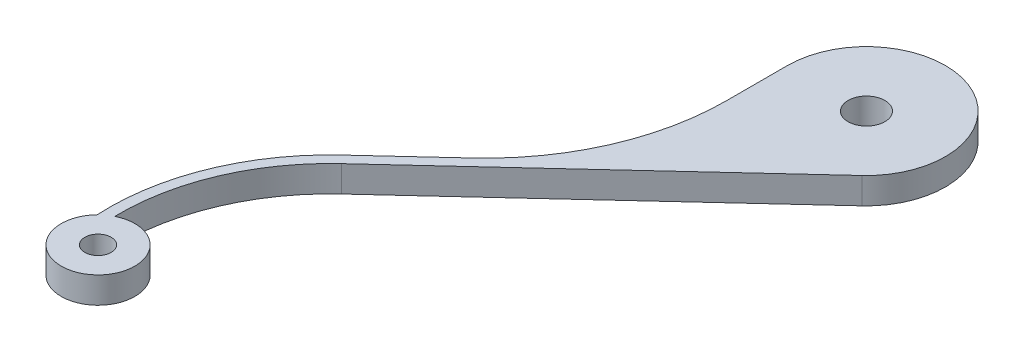
ISO-10303-21;
HEADER;
FILE_DESCRIPTION(('STEP AP214'),'2;1');
FILE_NAME('part.step','',(''),(''),'','','');
FILE_SCHEMA(('AUTOMOTIVE_DESIGN { 1 0 10303 214 1 1 1 1 }'));
ENDSEC;
DATA;
#1=APPLICATION_CONTEXT('core data for automotive mechanical design processes');
#2=APPLICATION_PROTOCOL_DEFINITION('international standard','automotive_design',2000,#1);
#3=PRODUCT_CONTEXT('',#1,'mechanical');
#4=PRODUCT('Part','Part','',(#3));
#5=PRODUCT_RELATED_PRODUCT_CATEGORY('part','',(#4));
#6=PRODUCT_DEFINITION_FORMATION('','',#4);
#7=PRODUCT_DEFINITION_CONTEXT('part definition',#1,'design');
#8=PRODUCT_DEFINITION('design','',#6,#7);
#9=PRODUCT_DEFINITION_SHAPE('','',#8);
#10=(LENGTH_UNIT() NAMED_UNIT(*) SI_UNIT(.MILLI.,.METRE.));
#11=(NAMED_UNIT(*) PLANE_ANGLE_UNIT() SI_UNIT($,.RADIAN.));
#12=(NAMED_UNIT(*) SI_UNIT($,.STERADIAN.) SOLID_ANGLE_UNIT());
#13=UNCERTAINTY_MEASURE_WITH_UNIT(LENGTH_MEASURE(1.E-05),#10,'distance_accuracy_value','');
#14=(GEOMETRIC_REPRESENTATION_CONTEXT(3) GLOBAL_UNCERTAINTY_ASSIGNED_CONTEXT((#13)) GLOBAL_UNIT_ASSIGNED_CONTEXT((#10,
#11,#12)) REPRESENTATION_CONTEXT('',''));
#15=CARTESIAN_POINT('',(0.,0.,0.));
#16=DIRECTION('',(0.,0.,1.));
#17=DIRECTION('',(1.,0.,0.));
#18=AXIS2_PLACEMENT_3D('',#15,#16,#17);
#19=CARTESIAN_POINT('',(0.,5.,0.));
#20=DIRECTION('',(0.,1.,0.));
#21=DIRECTION('',(0.,0.,1.));
#22=AXIS2_PLACEMENT_3D('',#19,#20,#21);
#23=PLANE('',#22);
#24=CARTESIAN_POINT('',(0.,5.,0.));
#25=DIRECTION('',(0.,1.,0.));
#26=DIRECTION('',(0.,0.,1.));
#27=AXIS2_PLACEMENT_3D('',#24,#25,#26);
#28=CIRCLE('',#27,3.5);
#29=CARTESIAN_POINT('',(0.,5.,3.5));
#30=VERTEX_POINT('',#29);
#31=EDGE_CURVE('E132',#30,#30,#28,.T.);
#32=ORIENTED_EDGE('',*,*,#31,.F.);
#33=EDGE_LOOP('',(#32));
#34=FACE_BOUND('',#33,.T.);
#35=CARTESIAN_POINT('',(0.,5.,0.));
#36=DIRECTION('',(0.,1.,0.));
#37=DIRECTION('',(0.,0.,1.));
#38=AXIS2_PLACEMENT_3D('',#35,#36,#37);
#39=CIRCLE('',#38,15.);
#40=CARTESIAN_POINT('',(10.1804788039535,5.,11.016253960501));
#41=VERTEX_POINT('',#40);
#42=CARTESIAN_POINT('',(-15.,5.,0.));
#43=VERTEX_POINT('',#42);
#44=EDGE_CURVE('E143',#41,#43,#39,.T.);
#45=ORIENTED_EDGE('',*,*,#44,.T.);
#46=DIRECTION('',(0.,0.,1.));
#47=VECTOR('',#46,1.);
#48=CARTESIAN_POINT('',(-15.,5.,0.));
#49=LINE('',#48,#47);
#50=CARTESIAN_POINT('',(-15.,5.,11.5189970029999));
#51=VERTEX_POINT('',#50);
#52=EDGE_CURVE('E91',#43,#51,#49,.T.);
#53=ORIENTED_EDGE('',*,*,#52,.T.);
#54=CARTESIAN_POINT('',(-60.8159590386569,5.,11.5189970029999));
#55=DIRECTION('',(0.,-1.,0.));
#56=DIRECTION('',(0.,0.,-1.));
#57=AXIS2_PLACEMENT_3D('',#54,#55,#56);
#58=CIRCLE('',#57,45.8159590386569);
#59=CARTESIAN_POINT('',(-29.7207323802671,5.,45.1670130172502));
#60=VERTEX_POINT('',#59);
#61=EDGE_CURVE('E158',#51,#60,#58,.T.);
#62=ORIENTED_EDGE('',*,*,#61,.T.);
#63=DIRECTION('',(-0.734416930700067,0.,0.678698586930231));
#64=VECTOR('',#63,1.);
#65=CARTESIAN_POINT('',(-29.7207323802671,5.,45.1670130172502));
#66=LINE('',#65,#64);
#67=CARTESIAN_POINT('',(-42.5861035189116,5.,57.0563211842171));
#68=VERTEX_POINT('',#67);
#69=EDGE_CURVE('E171',#60,#68,#66,.T.);
#70=ORIENTED_EDGE('',*,*,#69,.T.);
#71=CARTESIAN_POINT('',(-14.0807628678419,5.,87.9018322736199));
#72=DIRECTION('',(0.,1.,0.));
#73=DIRECTION('',(0.,0.,1.));
#74=AXIS2_PLACEMENT_3D('',#71,#72,#73);
#75=CIRCLE('',#74,42.);
#76=CARTESIAN_POINT('',(-56.0210743435811,5.,90.1401962560815));
#77=VERTEX_POINT('',#76);
#78=EDGE_CURVE('E110',#68,#77,#75,.T.);
#79=ORIENTED_EDGE('',*,*,#78,.T.);
#80=CARTESIAN_POINT('',(-50.9829886386138,5.,95.));
#81=DIRECTION('',(0.,1.,0.));
#82=DIRECTION('',(0.,0.,-1.));
#83=AXIS2_PLACEMENT_3D('',#80,#81,#82);
#84=CIRCLE('',#83,7.00000000000001);
#85=CARTESIAN_POINT('',(-54.0724221774994,5.,88.7186466101));
#86=VERTEX_POINT('',#85);
#87=EDGE_CURVE('E104',#77,#86,#84,.T.);
#88=ORIENTED_EDGE('',*,*,#87,.T.);
#89=CARTESIAN_POINT('',(-14.0807628678419,5.,87.9018322736199));
#90=DIRECTION('',(0.,-1.,0.));
#91=DIRECTION('',(0.,0.,1.));
#92=AXIS2_PLACEMENT_3D('',#89,#90,#91);
#93=CIRCLE('',#92,40.);
#94=CARTESIAN_POINT('',(-41.2287063450512,5.,58.5251550456173));
#95=VERTEX_POINT('',#94);
#96=EDGE_CURVE('E108',#86,#95,#93,.T.);
#97=ORIENTED_EDGE('',*,*,#96,.T.);
#98=DIRECTION('',(0.734416930700066,0.,-0.678698586930232));
#99=VECTOR('',#98,1.);
#100=CARTESIAN_POINT('',(10.1804788039535,5.,11.016253960501));
#101=LINE('',#100,#99);
#102=EDGE_CURVE('E48',#95,#41,#101,.T.);
#103=ORIENTED_EDGE('',*,*,#102,.T.);
#104=EDGE_LOOP('',(#45,#53,#62,#70,#79,#88,#97,#103));
#105=FACE_BOUND('',#104,.T.);
#106=CARTESIAN_POINT('',(-50.9829886386138,5.,95.));
#107=DIRECTION('',(0.,1.,0.));
#108=DIRECTION('',(0.,0.,1.));
#109=AXIS2_PLACEMENT_3D('',#106,#107,#108);
#110=CIRCLE('',#109,2.5);
#111=CARTESIAN_POINT('',(-50.9829886386138,5.,97.5));
#112=VERTEX_POINT('',#111);
#113=EDGE_CURVE('E180',#112,#112,#110,.T.);
#114=ORIENTED_EDGE('',*,*,#113,.F.);
#115=EDGE_LOOP('',(#114));
#116=FACE_BOUND('',#115,.T.);
#117=ADVANCED_FACE('F31',(#34,#105,#116),#23,.T.);
#118=CARTESIAN_POINT('',(0.,0.,0.));
#119=DIRECTION('',(0.,1.,0.));
#120=DIRECTION('',(0.,0.,1.));
#121=AXIS2_PLACEMENT_3D('',#118,#119,#120);
#122=PLANE('',#121);
#123=CARTESIAN_POINT('',(0.,0.,0.));
#124=DIRECTION('',(0.,1.,0.));
#125=DIRECTION('',(0.,0.,1.));
#126=AXIS2_PLACEMENT_3D('',#123,#124,#125);
#127=CIRCLE('',#126,3.5);
#128=CARTESIAN_POINT('',(0.,0.,3.5));
#129=VERTEX_POINT('',#128);
#130=EDGE_CURVE('E177',#129,#129,#127,.T.);
#131=ORIENTED_EDGE('',*,*,#130,.T.);
#132=EDGE_LOOP('',(#131));
#133=FACE_BOUND('',#132,.T.);
#134=CARTESIAN_POINT('',(0.,0.,0.));
#135=DIRECTION('',(0.,1.,0.));
#136=DIRECTION('',(0.,0.,1.));
#137=AXIS2_PLACEMENT_3D('',#134,#135,#136);
#138=CIRCLE('',#137,15.);
#139=CARTESIAN_POINT('',(10.1804788039535,0.,11.016253960501));
#140=VERTEX_POINT('',#139);
#141=CARTESIAN_POINT('',(-15.,0.,0.));
#142=VERTEX_POINT('',#141);
#143=EDGE_CURVE('E128',#140,#142,#138,.T.);
#144=ORIENTED_EDGE('',*,*,#143,.F.);
#145=DIRECTION('',(0.734416930700066,0.,-0.678698586930232));
#146=VECTOR('',#145,1.);
#147=CARTESIAN_POINT('',(10.1804788039535,0.,11.016253960501));
#148=LINE('',#147,#146);
#149=CARTESIAN_POINT('',(-41.2287063450512,0.,58.5251550456173));
#150=VERTEX_POINT('',#149);
#151=EDGE_CURVE('E83',#150,#140,#148,.T.);
#152=ORIENTED_EDGE('',*,*,#151,.F.);
#153=CARTESIAN_POINT('',(-14.0807628678419,0.,87.9018322736199));
#154=DIRECTION('',(0.,-1.,0.));
#155=DIRECTION('',(0.,0.,1.));
#156=AXIS2_PLACEMENT_3D('',#153,#154,#155);
#157=CIRCLE('',#156,40.);
#158=CARTESIAN_POINT('',(-54.0724221774994,0.,88.7186466101));
#159=VERTEX_POINT('',#158);
#160=EDGE_CURVE('E77',#159,#150,#157,.T.);
#161=ORIENTED_EDGE('',*,*,#160,.F.);
#162=CARTESIAN_POINT('',(-50.9829886386138,0.,95.));
#163=DIRECTION('',(0.,1.,0.));
#164=DIRECTION('',(0.,0.,-1.));
#165=AXIS2_PLACEMENT_3D('',#162,#163,#164);
#166=CIRCLE('',#165,7.00000000000001);
#167=CARTESIAN_POINT('',(-56.0210743435811,0.,90.1401962560815));
#168=VERTEX_POINT('',#167);
#169=EDGE_CURVE('E118',#168,#159,#166,.T.);
#170=ORIENTED_EDGE('',*,*,#169,.F.);
#171=CARTESIAN_POINT('',(-14.0807628678419,0.,87.9018322736199));
#172=DIRECTION('',(0.,1.,0.));
#173=DIRECTION('',(0.,0.,1.));
#174=AXIS2_PLACEMENT_3D('',#171,#172,#173);
#175=CIRCLE('',#174,42.);
#176=CARTESIAN_POINT('',(-42.5861035189116,0.,57.0563211842171));
#177=VERTEX_POINT('',#176);
#178=EDGE_CURVE('E138',#177,#168,#175,.T.);
#179=ORIENTED_EDGE('',*,*,#178,.F.);
#180=DIRECTION('',(-0.734416930700067,0.,0.678698586930231));
#181=VECTOR('',#180,1.);
#182=CARTESIAN_POINT('',(-29.7207323802671,0.,45.1670130172502));
#183=LINE('',#182,#181);
#184=CARTESIAN_POINT('',(-29.7207323802671,0.,45.1670130172502));
#185=VERTEX_POINT('',#184);
#186=EDGE_CURVE('E136',#185,#177,#183,.T.);
#187=ORIENTED_EDGE('',*,*,#186,.F.);
#188=CARTESIAN_POINT('',(-60.8159590386569,0.,11.5189970029999));
#189=DIRECTION('',(0.,-1.,0.));
#190=DIRECTION('',(0.,0.,-1.));
#191=AXIS2_PLACEMENT_3D('',#188,#189,#190);
#192=CIRCLE('',#191,45.8159590386569);
#193=CARTESIAN_POINT('',(-15.,0.,11.5189970029999));
#194=VERTEX_POINT('',#193);
#195=EDGE_CURVE('E134',#194,#185,#192,.T.);
#196=ORIENTED_EDGE('',*,*,#195,.F.);
#197=DIRECTION('',(0.,0.,1.));
#198=VECTOR('',#197,1.);
#199=CARTESIAN_POINT('',(-15.,0.,0.));
#200=LINE('',#199,#198);
#201=EDGE_CURVE('E131',#142,#194,#200,.T.);
#202=ORIENTED_EDGE('',*,*,#201,.F.);
#203=EDGE_LOOP('',(#144,#152,#161,#170,#179,#187,#196,#202));
#204=FACE_BOUND('',#203,.T.);
#205=CARTESIAN_POINT('',(-50.9829886386138,0.,95.));
#206=DIRECTION('',(0.,1.,0.));
#207=DIRECTION('',(0.,0.,1.));
#208=AXIS2_PLACEMENT_3D('',#205,#206,#207);
#209=CIRCLE('',#208,2.5);
#210=CARTESIAN_POINT('',(-50.9829886386138,0.,97.5));
#211=VERTEX_POINT('',#210);
#212=EDGE_CURVE('E183',#211,#211,#209,.T.);
#213=ORIENTED_EDGE('',*,*,#212,.T.);
#214=EDGE_LOOP('',(#213));
#215=FACE_BOUND('',#214,.T.);
#216=ADVANCED_FACE('F162',(#133,#204,#215),#122,.F.);
#217=CARTESIAN_POINT('',(0.,5.,0.));
#218=DIRECTION('',(0.,-1.,0.));
#219=DIRECTION('',(0.,0.,-1.));
#220=AXIS2_PLACEMENT_3D('',#217,#218,#219);
#221=CYLINDRICAL_SURFACE('',#220,15.);
#222=ORIENTED_EDGE('',*,*,#143,.T.);
#223=DIRECTION('',(0.,-1.,0.));
#224=VECTOR('',#223,1.);
#225=CARTESIAN_POINT('',(-15.,5.,0.));
#226=LINE('',#225,#224);
#227=EDGE_CURVE('E11',#43,#142,#226,.T.);
#228=ORIENTED_EDGE('',*,*,#227,.F.);
#229=ORIENTED_EDGE('',*,*,#44,.F.);
#230=DIRECTION('',(0.,-1.,0.));
#231=VECTOR('',#230,1.);
#232=CARTESIAN_POINT('',(10.1804788039535,5.,11.016253960501));
#233=LINE('',#232,#231);
#234=EDGE_CURVE('E124',#41,#140,#233,.T.);
#235=ORIENTED_EDGE('',*,*,#234,.T.);
#236=EDGE_LOOP('',(#222,#228,#229,#235));
#237=FACE_BOUND('',#236,.T.);
#238=ADVANCED_FACE('F33',(#237),#221,.T.);
#239=CARTESIAN_POINT('',(-15.,5.,0.));
#240=DIRECTION('',(1.,0.,0.));
#241=DIRECTION('',(0.,0.,-1.));
#242=AXIS2_PLACEMENT_3D('',#239,#240,#241);
#243=PLANE('',#242);
#244=ORIENTED_EDGE('',*,*,#201,.T.);
#245=DIRECTION('',(0.,-1.,0.));
#246=VECTOR('',#245,1.);
#247=CARTESIAN_POINT('',(-15.,5.,11.5189970029999));
#248=LINE('',#247,#246);
#249=EDGE_CURVE('E40',#51,#194,#248,.T.);
#250=ORIENTED_EDGE('',*,*,#249,.F.);
#251=ORIENTED_EDGE('',*,*,#52,.F.);
#252=ORIENTED_EDGE('',*,*,#227,.T.);
#253=EDGE_LOOP('',(#244,#250,#251,#252));
#254=FACE_BOUND('',#253,.T.);
#255=ADVANCED_FACE('F216',(#254),#243,.F.);
#256=CARTESIAN_POINT('',(-60.8159590386569,5.,11.5189970029999));
#257=DIRECTION('',(0.,-1.,0.));
#258=DIRECTION('',(0.,0.,-1.));
#259=AXIS2_PLACEMENT_3D('',#256,#257,#258);
#260=CYLINDRICAL_SURFACE('',#259,45.8159590386569);
#261=ORIENTED_EDGE('',*,*,#195,.T.);
#262=DIRECTION('',(0.,-1.,0.));
#263=VECTOR('',#262,1.);
#264=CARTESIAN_POINT('',(-29.7207323802671,5.,45.1670130172502));
#265=LINE('',#264,#263);
#266=EDGE_CURVE('E150',#60,#185,#265,.T.);
#267=ORIENTED_EDGE('',*,*,#266,.F.);
#268=ORIENTED_EDGE('',*,*,#61,.F.);
#269=ORIENTED_EDGE('',*,*,#249,.T.);
#270=EDGE_LOOP('',(#261,#267,#268,#269));
#271=FACE_BOUND('',#270,.T.);
#272=ADVANCED_FACE('F156',(#271),#260,.F.);
#273=CARTESIAN_POINT('',(-29.7207323802671,5.,45.1670130172502));
#274=DIRECTION('',(0.678698586930231,0.,0.734416930700067));
#275=DIRECTION('',(0.734416930700067,0.,-0.678698586930231));
#276=AXIS2_PLACEMENT_3D('',#273,#274,#275);
#277=PLANE('',#276);
#278=ORIENTED_EDGE('',*,*,#186,.T.);
#279=DIRECTION('',(0.,-1.,0.));
#280=VECTOR('',#279,1.);
#281=CARTESIAN_POINT('',(-42.5861035189116,5.,57.0563211842171));
#282=LINE('',#281,#280);
#283=EDGE_CURVE('E147',#68,#177,#282,.T.);
#284=ORIENTED_EDGE('',*,*,#283,.F.);
#285=ORIENTED_EDGE('',*,*,#69,.F.);
#286=ORIENTED_EDGE('',*,*,#266,.T.);
#287=EDGE_LOOP('',(#278,#284,#285,#286));
#288=FACE_BOUND('',#287,.T.);
#289=ADVANCED_FACE('F167',(#288),#277,.F.);
#290=CARTESIAN_POINT('',(-14.0807628678419,5.,87.9018322736199));
#291=DIRECTION('',(0.,-1.,0.));
#292=DIRECTION('',(0.,0.,-1.));
#293=AXIS2_PLACEMENT_3D('',#290,#291,#292);
#294=CYLINDRICAL_SURFACE('',#293,42.);
#295=ORIENTED_EDGE('',*,*,#178,.T.);
#296=DIRECTION('',(0.,-1.,0.));
#297=VECTOR('',#296,1.);
#298=CARTESIAN_POINT('',(-56.0210743435811,5.,90.1401962560815));
#299=LINE('',#298,#297);
#300=EDGE_CURVE('E119',#77,#168,#299,.T.);
#301=ORIENTED_EDGE('',*,*,#300,.F.);
#302=ORIENTED_EDGE('',*,*,#78,.F.);
#303=ORIENTED_EDGE('',*,*,#283,.T.);
#304=EDGE_LOOP('',(#295,#301,#302,#303));
#305=FACE_BOUND('',#304,.T.);
#306=ADVANCED_FACE('F170',(#305),#294,.T.);
#307=CARTESIAN_POINT('',(-50.9829886386138,5.,95.));
#308=DIRECTION('',(0.,-1.,0.));
#309=DIRECTION('',(0.,0.,-1.));
#310=AXIS2_PLACEMENT_3D('',#307,#308,#309);
#311=CYLINDRICAL_SURFACE('',#310,7.00000000000001);
#312=ORIENTED_EDGE('',*,*,#169,.T.);
#313=DIRECTION('',(0.,-1.,0.));
#314=VECTOR('',#313,1.);
#315=CARTESIAN_POINT('',(-54.0724221774994,5.,88.7186466101));
#316=LINE('',#315,#314);
#317=EDGE_CURVE('E115',#86,#159,#316,.T.);
#318=ORIENTED_EDGE('',*,*,#317,.F.);
#319=ORIENTED_EDGE('',*,*,#87,.F.);
#320=ORIENTED_EDGE('',*,*,#300,.T.);
#321=EDGE_LOOP('',(#312,#318,#319,#320));
#322=FACE_BOUND('',#321,.T.);
#323=ADVANCED_FACE('F116',(#322),#311,.T.);
#324=CARTESIAN_POINT('',(-14.0807628678419,5.,87.9018322736199));
#325=DIRECTION('',(0.,-1.,0.));
#326=DIRECTION('',(0.,0.,-1.));
#327=AXIS2_PLACEMENT_3D('',#324,#325,#326);
#328=CYLINDRICAL_SURFACE('',#327,40.);
#329=ORIENTED_EDGE('',*,*,#160,.T.);
#330=DIRECTION('',(0.,-1.,0.));
#331=VECTOR('',#330,1.);
#332=CARTESIAN_POINT('',(-41.2287063450512,5.,58.5251550456173));
#333=LINE('',#332,#331);
#334=EDGE_CURVE('E120',#95,#150,#333,.T.);
#335=ORIENTED_EDGE('',*,*,#334,.F.);
#336=ORIENTED_EDGE('',*,*,#96,.F.);
#337=ORIENTED_EDGE('',*,*,#317,.T.);
#338=EDGE_LOOP('',(#329,#335,#336,#337));
#339=FACE_BOUND('',#338,.T.);
#340=ADVANCED_FACE('F122',(#339),#328,.F.);
#341=CARTESIAN_POINT('',(10.1804788039535,5.,11.016253960501));
#342=DIRECTION('',(-0.678698586930232,0.,-0.734416930700066));
#343=DIRECTION('',(-0.734416930700066,0.,0.678698586930232));
#344=AXIS2_PLACEMENT_3D('',#341,#342,#343);
#345=PLANE('',#344);
#346=ORIENTED_EDGE('',*,*,#151,.T.);
#347=ORIENTED_EDGE('',*,*,#234,.F.);
#348=ORIENTED_EDGE('',*,*,#102,.F.);
#349=ORIENTED_EDGE('',*,*,#334,.T.);
#350=EDGE_LOOP('',(#346,#347,#348,#349));
#351=FACE_BOUND('',#350,.T.);
#352=ADVANCED_FACE('F204',(#351),#345,.F.);
#353=CARTESIAN_POINT('',(0.,5.,0.));
#354=DIRECTION('',(0.,-1.,0.));
#355=DIRECTION('',(0.,0.,-1.));
#356=AXIS2_PLACEMENT_3D('',#353,#354,#355);
#357=CYLINDRICAL_SURFACE('',#356,3.5);
#358=ORIENTED_EDGE('',*,*,#31,.T.);
#359=EDGE_LOOP('',(#358));
#360=FACE_BOUND('',#359,.T.);
#361=ORIENTED_EDGE('',*,*,#130,.F.);
#362=EDGE_LOOP('',(#361));
#363=FACE_BOUND('',#362,.T.);
#364=ADVANCED_FACE('F201',(#360,#363),#357,.F.);
#365=CARTESIAN_POINT('',(-50.9829886386138,5.,95.));
#366=DIRECTION('',(0.,-1.,0.));
#367=DIRECTION('',(0.,0.,-1.));
#368=AXIS2_PLACEMENT_3D('',#365,#366,#367);
#369=CYLINDRICAL_SURFACE('',#368,2.5);
#370=ORIENTED_EDGE('',*,*,#113,.T.);
#371=EDGE_LOOP('',(#370));
#372=FACE_BOUND('',#371,.T.);
#373=ORIENTED_EDGE('',*,*,#212,.F.);
#374=EDGE_LOOP('',(#373));
#375=FACE_BOUND('',#374,.T.);
#376=ADVANCED_FACE('F189',(#372,#375),#369,.F.);
#377=CLOSED_SHELL('',(#117,#216,#238,#255,#272,#289,#306,#323,#340,#352,#364,#376));
#378=MANIFOLD_SOLID_BREP('B2',#377);
#379=ADVANCED_BREP_SHAPE_REPRESENTATION('',(#18,#378),#14);
#380=SHAPE_DEFINITION_REPRESENTATION(#9,#379);
ENDSEC;
END-ISO-10303-21;
